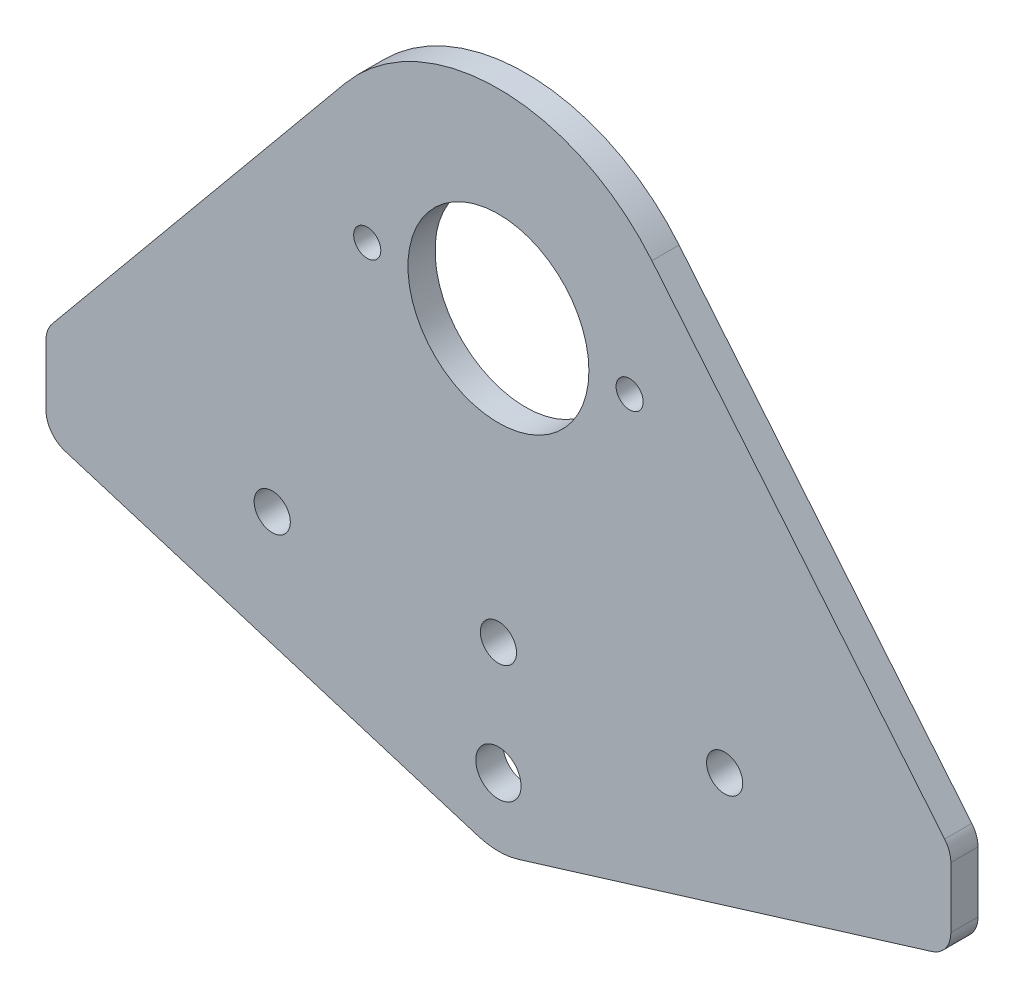
ISO-10303-21;
HEADER;
FILE_DESCRIPTION(('STEP AP214'),'2;1');
FILE_NAME('part.step','',(''),(''),'','','');
FILE_SCHEMA(('AUTOMOTIVE_DESIGN { 1 0 10303 214 1 1 1 1 }'));
ENDSEC;
DATA;
#1=APPLICATION_CONTEXT('core data for automotive mechanical design processes');
#2=APPLICATION_PROTOCOL_DEFINITION('international standard','automotive_design',2000,#1);
#3=PRODUCT_CONTEXT('',#1,'mechanical');
#4=PRODUCT('Part','Part','',(#3));
#5=PRODUCT_RELATED_PRODUCT_CATEGORY('part','',(#4));
#6=PRODUCT_DEFINITION_FORMATION('','',#4);
#7=PRODUCT_DEFINITION_CONTEXT('part definition',#1,'design');
#8=PRODUCT_DEFINITION('design','',#6,#7);
#9=PRODUCT_DEFINITION_SHAPE('','',#8);
#10=(LENGTH_UNIT() NAMED_UNIT(*) SI_UNIT(.MILLI.,.METRE.));
#11=(NAMED_UNIT(*) PLANE_ANGLE_UNIT() SI_UNIT($,.RADIAN.));
#12=(NAMED_UNIT(*) SI_UNIT($,.STERADIAN.) SOLID_ANGLE_UNIT());
#13=UNCERTAINTY_MEASURE_WITH_UNIT(LENGTH_MEASURE(1.E-05),#10,'distance_accuracy_value','');
#14=(GEOMETRIC_REPRESENTATION_CONTEXT(3) GLOBAL_UNCERTAINTY_ASSIGNED_CONTEXT((#13)) GLOBAL_UNIT_ASSIGNED_CONTEXT((#10,
#11,#12)) REPRESENTATION_CONTEXT('',''));
#15=CARTESIAN_POINT('',(0.,0.,0.));
#16=DIRECTION('',(0.,0.,1.));
#17=DIRECTION('',(1.,0.,0.));
#18=AXIS2_PLACEMENT_3D('',#15,#16,#17);
#19=CARTESIAN_POINT('',(-14.4016355712842,-46.9253292364345,3.));
#20=DIRECTION('',(0.293398533007335,0.9559902200489,0.));
#21=DIRECTION('',(-0.9559902200489,0.293398533007335,0.));
#22=AXIS2_PLACEMENT_3D('',#19,#20,#21);
#23=PLANE('',#22);
#24=DIRECTION('',(0.9559902200489,-0.293398533007335,0.));
#25=VECTOR('',#24,1.);
#26=CARTESIAN_POINT('',(-14.4016355712842,-46.9253292364345,3.));
#27=LINE('',#26,#25);
#28=CARTESIAN_POINT('',(-47.880195599022,-36.6505793557989,3.));
#29=VERTEX_POINT('',#28);
#30=CARTESIAN_POINT('',(-2.20048899755501,-50.6699266503668,3.));
#31=VERTEX_POINT('',#30);
#32=EDGE_CURVE('E138',#29,#31,#27,.T.);
#33=ORIENTED_EDGE('',*,*,#32,.F.);
#34=DIRECTION('',(0.,0.,-1.));
#35=VECTOR('',#34,1.);
#36=CARTESIAN_POINT('',(-47.880195599022,-36.6505793557989,0.));
#37=LINE('',#36,#35);
#38=CARTESIAN_POINT('',(-47.880195599022,-36.6505793557989,0.));
#39=VERTEX_POINT('',#38);
#40=EDGE_CURVE('E206',#29,#39,#37,.T.);
#41=ORIENTED_EDGE('',*,*,#40,.T.);
#42=DIRECTION('',(0.9559902200489,-0.293398533007335,0.));
#43=VECTOR('',#42,1.);
#44=CARTESIAN_POINT('',(-14.4016355712842,-46.9253292364345,0.));
#45=LINE('',#44,#43);
#46=CARTESIAN_POINT('',(-2.20048899755501,-50.6699266503668,0.));
#47=VERTEX_POINT('',#46);
#48=EDGE_CURVE('E165',#39,#47,#45,.T.);
#49=ORIENTED_EDGE('',*,*,#48,.T.);
#50=DIRECTION('',(0.,0.,-1.));
#51=VECTOR('',#50,1.);
#52=CARTESIAN_POINT('',(-2.20048899755501,-50.6699266503668,3.));
#53=LINE('',#52,#51);
#54=EDGE_CURVE('E158',#31,#47,#53,.T.);
#55=ORIENTED_EDGE('',*,*,#54,.F.);
#56=EDGE_LOOP('',(#33,#41,#49,#55));
#57=FACE_BOUND('',#56,.T.);
#58=ADVANCED_FACE('F47',(#57),#23,.F.);
#59=CARTESIAN_POINT('',(0.,-43.5,3.));
#60=DIRECTION('',(0.,0.,-1.));
#61=DIRECTION('',(-1.,0.,0.));
#62=AXIS2_PLACEMENT_3D('',#59,#60,#61);
#63=CYLINDRICAL_SURFACE('',#62,7.5);
#64=CARTESIAN_POINT('',(0.,-43.5,0.));
#65=DIRECTION('',(0.,0.,1.));
#66=DIRECTION('',(1.,0.,0.));
#67=AXIS2_PLACEMENT_3D('',#64,#65,#66);
#68=CIRCLE('',#67,7.5);
#69=CARTESIAN_POINT('',(2.20048899755501,-50.6699266503668,0.));
#70=VERTEX_POINT('',#69);
#71=EDGE_CURVE('E297',#47,#70,#68,.T.);
#72=ORIENTED_EDGE('',*,*,#71,.T.);
#73=DIRECTION('',(0.,0.,-1.));
#74=VECTOR('',#73,1.);
#75=CARTESIAN_POINT('',(2.20048899755501,-50.6699266503668,3.));
#76=LINE('',#75,#74);
#77=CARTESIAN_POINT('',(2.20048899755501,-50.6699266503668,3.));
#78=VERTEX_POINT('',#77);
#79=EDGE_CURVE('E160',#78,#70,#76,.T.);
#80=ORIENTED_EDGE('',*,*,#79,.F.);
#81=CARTESIAN_POINT('',(0.,-43.5,3.));
#82=DIRECTION('',(0.,0.,1.));
#83=DIRECTION('',(1.,0.,0.));
#84=AXIS2_PLACEMENT_3D('',#81,#82,#83);
#85=CIRCLE('',#84,7.5);
#86=EDGE_CURVE('E143',#31,#78,#85,.T.);
#87=ORIENTED_EDGE('',*,*,#86,.F.);
#88=ORIENTED_EDGE('',*,*,#54,.T.);
#89=EDGE_LOOP('',(#72,#80,#87,#88));
#90=FACE_BOUND('',#89,.T.);
#91=ADVANCED_FACE('F157',(#90),#63,.T.);
#92=CARTESIAN_POINT('',(14.4016355712843,-46.9253292364345,3.));
#93=DIRECTION('',(0.293398533007335,-0.9559902200489,0.));
#94=DIRECTION('',(0.9559902200489,0.293398533007335,0.));
#95=AXIS2_PLACEMENT_3D('',#92,#93,#94);
#96=PLANE('',#95);
#97=DIRECTION('',(-0.9559902200489,-0.293398533007335,0.));
#98=VECTOR('',#97,1.);
#99=CARTESIAN_POINT('',(14.4016355712843,-46.9253292364345,0.));
#100=LINE('',#99,#98);
#101=CARTESIAN_POINT('',(47.880195599022,-36.6505793557989,0.));
#102=VERTEX_POINT('',#101);
#103=EDGE_CURVE('E294',#102,#70,#100,.T.);
#104=ORIENTED_EDGE('',*,*,#103,.F.);
#105=DIRECTION('',(0.,0.,-1.));
#106=VECTOR('',#105,1.);
#107=CARTESIAN_POINT('',(47.880195599022,-36.6505793557989,3.));
#108=LINE('',#107,#106);
#109=CARTESIAN_POINT('',(47.880195599022,-36.6505793557989,3.));
#110=VERTEX_POINT('',#109);
#111=EDGE_CURVE('E193',#102,#110,#108,.F.);
#112=ORIENTED_EDGE('',*,*,#111,.T.);
#113=DIRECTION('',(-0.9559902200489,-0.293398533007335,0.));
#114=VECTOR('',#113,1.);
#115=CARTESIAN_POINT('',(14.4016355712843,-46.9253292364345,3.));
#116=LINE('',#115,#114);
#117=EDGE_CURVE('E162',#110,#78,#116,.T.);
#118=ORIENTED_EDGE('',*,*,#117,.T.);
#119=ORIENTED_EDGE('',*,*,#79,.T.);
#120=EDGE_LOOP('',(#104,#112,#118,#119));
#121=FACE_BOUND('',#120,.T.);
#122=ADVANCED_FACE('F343',(#121),#96,.T.);
#123=CARTESIAN_POINT('',(50.,0.,3.));
#124=DIRECTION('',(1.,0.,0.));
#125=DIRECTION('',(0.,0.,-1.));
#126=AXIS2_PLACEMENT_3D('',#123,#124,#125);
#127=PLANE('',#126);
#128=DIRECTION('',(0.,-1.,0.));
#129=VECTOR('',#128,1.);
#130=CARTESIAN_POINT('',(50.,0.,3.));
#131=LINE('',#130,#129);
#132=CARTESIAN_POINT('',(50.,-27.0785202951788,3.));
#133=VERTEX_POINT('',#132);
#134=CARTESIAN_POINT('',(50.,-33.7826086956522,3.));
#135=VERTEX_POINT('',#134);
#136=EDGE_CURVE('E336',#133,#135,#131,.T.);
#137=ORIENTED_EDGE('',*,*,#136,.T.);
#138=DIRECTION('',(0.,0.,-1.));
#139=VECTOR('',#138,1.);
#140=CARTESIAN_POINT('',(50.,-33.7826086956522,3.));
#141=LINE('',#140,#139);
#142=CARTESIAN_POINT('',(50.,-33.7826086956522,0.));
#143=VERTEX_POINT('',#142);
#144=EDGE_CURVE('E172',#135,#143,#141,.T.);
#145=ORIENTED_EDGE('',*,*,#144,.T.);
#146=DIRECTION('',(0.,-1.,0.));
#147=VECTOR('',#146,1.);
#148=CARTESIAN_POINT('',(50.,0.,0.));
#149=LINE('',#148,#147);
#150=CARTESIAN_POINT('',(50.,-27.0785202951788,0.));
#151=VERTEX_POINT('',#150);
#152=EDGE_CURVE('E289',#151,#143,#149,.T.);
#153=ORIENTED_EDGE('',*,*,#152,.F.);
#154=DIRECTION('',(0.,0.,-1.));
#155=VECTOR('',#154,1.);
#156=CARTESIAN_POINT('',(50.,-27.0785202951788,3.));
#157=LINE('',#156,#155);
#158=EDGE_CURVE('E168',#151,#133,#157,.F.);
#159=ORIENTED_EDGE('',*,*,#158,.T.);
#160=EDGE_LOOP('',(#137,#145,#153,#159));
#161=FACE_BOUND('',#160,.T.);
#162=ADVANCED_FACE('F352',(#161),#127,.T.);
#163=CARTESIAN_POINT('',(16.9640826864656,14.0078513201261,3.));
#164=DIRECTION('',(-0.771094667566617,-0.636720514551187,0.));
#165=DIRECTION('',(0.636720514551187,-0.771094667566617,0.));
#166=AXIS2_PLACEMENT_3D('',#163,#164,#165);
#167=PLANE('',#166);
#168=DIRECTION('',(-0.636720514551187,0.771094667566617,0.));
#169=VECTOR('',#168,1.);
#170=CARTESIAN_POINT('',(16.9640826864656,14.0078513201261,3.));
#171=LINE('',#170,#169);
#172=CARTESIAN_POINT('',(49.3132840026999,-25.1683587515252,3.));
#173=VERTEX_POINT('',#172);
#174=CARTESIAN_POINT('',(16.9640826864656,14.0078513201261,3.));
#175=VERTEX_POINT('',#174);
#176=EDGE_CURVE('E333',#173,#175,#171,.T.);
#177=ORIENTED_EDGE('',*,*,#176,.F.);
#178=DIRECTION('',(0.,0.,-1.));
#179=VECTOR('',#178,1.);
#180=CARTESIAN_POINT('',(49.3132840026999,-25.1683587515252,0.));
#181=LINE('',#180,#179);
#182=CARTESIAN_POINT('',(49.3132840026999,-25.1683587515252,0.));
#183=VERTEX_POINT('',#182);
#184=EDGE_CURVE('E11',#173,#183,#181,.T.);
#185=ORIENTED_EDGE('',*,*,#184,.T.);
#186=DIRECTION('',(-0.636720514551187,0.771094667566617,0.));
#187=VECTOR('',#186,1.);
#188=CARTESIAN_POINT('',(16.9640826864656,14.0078513201261,0.));
#189=LINE('',#188,#187);
#190=CARTESIAN_POINT('',(16.9640826864656,14.0078513201261,0.));
#191=VERTEX_POINT('',#190);
#192=EDGE_CURVE('E286',#183,#191,#189,.T.);
#193=ORIENTED_EDGE('',*,*,#192,.T.);
#194=DIRECTION('',(0.,0.,-1.));
#195=VECTOR('',#194,1.);
#196=CARTESIAN_POINT('',(16.9640826864656,14.0078513201261,3.));
#197=LINE('',#196,#195);
#198=EDGE_CURVE('E174',#175,#191,#197,.T.);
#199=ORIENTED_EDGE('',*,*,#198,.F.);
#200=EDGE_LOOP('',(#177,#185,#193,#199));
#201=FACE_BOUND('',#200,.T.);
#202=ADVANCED_FACE('F357',(#201),#167,.F.);
#203=CARTESIAN_POINT('',(0.,0.,3.));
#204=DIRECTION('',(0.,0.,-1.));
#205=DIRECTION('',(-1.,0.,0.));
#206=AXIS2_PLACEMENT_3D('',#203,#204,#205);
#207=CYLINDRICAL_SURFACE('',#206,22.);
#208=CARTESIAN_POINT('',(0.,0.,0.));
#209=DIRECTION('',(0.,0.,1.));
#210=DIRECTION('',(1.,0.,0.));
#211=AXIS2_PLACEMENT_3D('',#208,#209,#210);
#212=CIRCLE('',#211,22.);
#213=CARTESIAN_POINT('',(-16.9640826864656,14.0078513201261,0.));
#214=VERTEX_POINT('',#213);
#215=EDGE_CURVE('E247',#191,#214,#212,.T.);
#216=ORIENTED_EDGE('',*,*,#215,.T.);
#217=DIRECTION('',(0.,0.,-1.));
#218=VECTOR('',#217,1.);
#219=CARTESIAN_POINT('',(-16.9640826864656,14.0078513201261,3.));
#220=LINE('',#219,#218);
#221=CARTESIAN_POINT('',(-16.9640826864656,14.0078513201261,3.));
#222=VERTEX_POINT('',#221);
#223=EDGE_CURVE('E273',#222,#214,#220,.T.);
#224=ORIENTED_EDGE('',*,*,#223,.F.);
#225=CARTESIAN_POINT('',(0.,0.,3.));
#226=DIRECTION('',(0.,0.,1.));
#227=DIRECTION('',(1.,0.,0.));
#228=AXIS2_PLACEMENT_3D('',#225,#226,#227);
#229=CIRCLE('',#228,22.);
#230=EDGE_CURVE('E225',#175,#222,#229,.T.);
#231=ORIENTED_EDGE('',*,*,#230,.F.);
#232=ORIENTED_EDGE('',*,*,#198,.T.);
#233=EDGE_LOOP('',(#216,#224,#231,#232));
#234=FACE_BOUND('',#233,.T.);
#235=ADVANCED_FACE('F282',(#234),#207,.T.);
#236=CARTESIAN_POINT('',(-16.9640826864656,14.0078513201261,3.));
#237=DIRECTION('',(-0.771094667566617,0.636720514551187,0.));
#238=DIRECTION('',(-0.636720514551187,-0.771094667566617,0.));
#239=AXIS2_PLACEMENT_3D('',#236,#237,#238);
#240=PLANE('',#239);
#241=DIRECTION('',(0.636720514551187,0.771094667566617,0.));
#242=VECTOR('',#241,1.);
#243=CARTESIAN_POINT('',(-16.9640826864656,14.0078513201261,0.));
#244=LINE('',#243,#242);
#245=CARTESIAN_POINT('',(-49.3132840026999,-25.1683587515253,0.));
#246=VERTEX_POINT('',#245);
#247=EDGE_CURVE('E222',#246,#214,#244,.T.);
#248=ORIENTED_EDGE('',*,*,#247,.F.);
#249=DIRECTION('',(0.,0.,-1.));
#250=VECTOR('',#249,1.);
#251=CARTESIAN_POINT('',(-49.3132840026999,-25.1683587515253,3.));
#252=LINE('',#251,#250);
#253=CARTESIAN_POINT('',(-49.3132840026999,-25.1683587515253,3.));
#254=VERTEX_POINT('',#253);
#255=EDGE_CURVE('E56',#246,#254,#252,.F.);
#256=ORIENTED_EDGE('',*,*,#255,.T.);
#257=DIRECTION('',(0.636720514551187,0.771094667566617,0.));
#258=VECTOR('',#257,1.);
#259=CARTESIAN_POINT('',(-16.9640826864656,14.0078513201261,3.));
#260=LINE('',#259,#258);
#261=EDGE_CURVE('E220',#254,#222,#260,.T.);
#262=ORIENTED_EDGE('',*,*,#261,.T.);
#263=ORIENTED_EDGE('',*,*,#223,.T.);
#264=EDGE_LOOP('',(#248,#256,#262,#263));
#265=FACE_BOUND('',#264,.T.);
#266=ADVANCED_FACE('F218',(#265),#240,.T.);
#267=CARTESIAN_POINT('',(14.5,0.,3.));
#268=DIRECTION('',(0.,0.,-1.));
#269=DIRECTION('',(-1.,0.,0.));
#270=AXIS2_PLACEMENT_3D('',#267,#268,#269);
#271=CYLINDRICAL_SURFACE('',#270,1.5);
#272=CARTESIAN_POINT('',(14.5,0.,3.));
#273=DIRECTION('',(0.,0.,1.));
#274=DIRECTION('',(1.,0.,0.));
#275=AXIS2_PLACEMENT_3D('',#272,#273,#274);
#276=CIRCLE('',#275,1.5);
#277=CARTESIAN_POINT('',(16.,0.,3.));
#278=VERTEX_POINT('',#277);
#279=EDGE_CURVE('E305',#278,#278,#276,.F.);
#280=ORIENTED_EDGE('',*,*,#279,.F.);
#281=EDGE_LOOP('',(#280));
#282=FACE_BOUND('',#281,.T.);
#283=CARTESIAN_POINT('',(14.5,0.,0.));
#284=DIRECTION('',(0.,0.,1.));
#285=DIRECTION('',(1.,0.,0.));
#286=AXIS2_PLACEMENT_3D('',#283,#284,#285);
#287=CIRCLE('',#286,1.5);
#288=CARTESIAN_POINT('',(16.,0.,0.));
#289=VERTEX_POINT('',#288);
#290=EDGE_CURVE('E266',#289,#289,#287,.F.);
#291=ORIENTED_EDGE('',*,*,#290,.T.);
#292=EDGE_LOOP('',(#291));
#293=FACE_BOUND('',#292,.T.);
#294=ADVANCED_FACE('F487',(#282,#293),#271,.F.);
#295=CARTESIAN_POINT('',(-14.5,0.,3.));
#296=DIRECTION('',(0.,0.,-1.));
#297=DIRECTION('',(-1.,0.,0.));
#298=AXIS2_PLACEMENT_3D('',#295,#296,#297);
#299=CYLINDRICAL_SURFACE('',#298,1.5);
#300=CARTESIAN_POINT('',(-14.5,0.,3.));
#301=DIRECTION('',(0.,0.,1.));
#302=DIRECTION('',(1.,0.,0.));
#303=AXIS2_PLACEMENT_3D('',#300,#301,#302);
#304=CIRCLE('',#303,1.5);
#305=CARTESIAN_POINT('',(-13.,0.,3.));
#306=VERTEX_POINT('',#305);
#307=EDGE_CURVE('E309',#306,#306,#304,.T.);
#308=ORIENTED_EDGE('',*,*,#307,.T.);
#309=EDGE_LOOP('',(#308));
#310=FACE_BOUND('',#309,.T.);
#311=CARTESIAN_POINT('',(-14.5,0.,0.));
#312=DIRECTION('',(0.,0.,1.));
#313=DIRECTION('',(1.,0.,0.));
#314=AXIS2_PLACEMENT_3D('',#311,#312,#313);
#315=CIRCLE('',#314,1.5);
#316=CARTESIAN_POINT('',(-13.,0.,0.));
#317=VERTEX_POINT('',#316);
#318=EDGE_CURVE('E262',#317,#317,#315,.T.);
#319=ORIENTED_EDGE('',*,*,#318,.F.);
#320=EDGE_LOOP('',(#319));
#321=FACE_BOUND('',#320,.T.);
#322=ADVANCED_FACE('F477',(#310,#321),#299,.F.);
#323=CARTESIAN_POINT('',(0.,0.,3.));
#324=DIRECTION('',(0.,0.,-1.));
#325=DIRECTION('',(-1.,0.,0.));
#326=AXIS2_PLACEMENT_3D('',#323,#324,#325);
#327=CYLINDRICAL_SURFACE('',#326,10.);
#328=CARTESIAN_POINT('',(0.,0.,3.));
#329=DIRECTION('',(0.,0.,1.));
#330=DIRECTION('',(1.,0.,0.));
#331=AXIS2_PLACEMENT_3D('',#328,#329,#330);
#332=CIRCLE('',#331,10.);
#333=CARTESIAN_POINT('',(10.,0.,3.));
#334=VERTEX_POINT('',#333);
#335=EDGE_CURVE('E313',#334,#334,#332,.T.);
#336=ORIENTED_EDGE('',*,*,#335,.T.);
#337=EDGE_LOOP('',(#336));
#338=FACE_BOUND('',#337,.T.);
#339=CARTESIAN_POINT('',(0.,0.,0.));
#340=DIRECTION('',(0.,0.,1.));
#341=DIRECTION('',(1.,0.,0.));
#342=AXIS2_PLACEMENT_3D('',#339,#340,#341);
#343=CIRCLE('',#342,10.);
#344=CARTESIAN_POINT('',(10.,0.,0.));
#345=VERTEX_POINT('',#344);
#346=EDGE_CURVE('E258',#345,#345,#343,.T.);
#347=ORIENTED_EDGE('',*,*,#346,.F.);
#348=EDGE_LOOP('',(#347));
#349=FACE_BOUND('',#348,.T.);
#350=ADVANCED_FACE('F467',(#338,#349),#327,.F.);
#351=CARTESIAN_POINT('',(25.,-31.,3.));
#352=DIRECTION('',(0.,0.,-1.));
#353=DIRECTION('',(-1.,0.,0.));
#354=AXIS2_PLACEMENT_3D('',#351,#352,#353);
#355=CYLINDRICAL_SURFACE('',#354,2.);
#356=CARTESIAN_POINT('',(25.,-31.,3.));
#357=DIRECTION('',(0.,0.,1.));
#358=DIRECTION('',(1.,0.,0.));
#359=AXIS2_PLACEMENT_3D('',#356,#357,#358);
#360=CIRCLE('',#359,2.);
#361=CARTESIAN_POINT('',(27.,-31.,3.));
#362=VERTEX_POINT('',#361);
#363=EDGE_CURVE('E317',#362,#362,#360,.F.);
#364=ORIENTED_EDGE('',*,*,#363,.F.);
#365=EDGE_LOOP('',(#364));
#366=FACE_BOUND('',#365,.T.);
#367=CARTESIAN_POINT('',(25.,-31.,0.));
#368=DIRECTION('',(0.,0.,1.));
#369=DIRECTION('',(1.,0.,0.));
#370=AXIS2_PLACEMENT_3D('',#367,#368,#369);
#371=CIRCLE('',#370,2.);
#372=CARTESIAN_POINT('',(27.,-31.,0.));
#373=VERTEX_POINT('',#372);
#374=EDGE_CURVE('E254',#373,#373,#371,.F.);
#375=ORIENTED_EDGE('',*,*,#374,.T.);
#376=EDGE_LOOP('',(#375));
#377=FACE_BOUND('',#376,.T.);
#378=ADVANCED_FACE('F457',(#366,#377),#355,.F.);
#379=CARTESIAN_POINT('',(-25.,-31.,3.));
#380=DIRECTION('',(0.,0.,-1.));
#381=DIRECTION('',(-1.,0.,0.));
#382=AXIS2_PLACEMENT_3D('',#379,#380,#381);
#383=CYLINDRICAL_SURFACE('',#382,2.);
#384=CARTESIAN_POINT('',(-25.,-31.,3.));
#385=DIRECTION('',(0.,0.,1.));
#386=DIRECTION('',(1.,0.,0.));
#387=AXIS2_PLACEMENT_3D('',#384,#385,#386);
#388=CIRCLE('',#387,2.);
#389=CARTESIAN_POINT('',(-23.,-31.,3.));
#390=VERTEX_POINT('',#389);
#391=EDGE_CURVE('E321',#390,#390,#388,.T.);
#392=ORIENTED_EDGE('',*,*,#391,.T.);
#393=EDGE_LOOP('',(#392));
#394=FACE_BOUND('',#393,.T.);
#395=CARTESIAN_POINT('',(-25.,-31.,0.));
#396=DIRECTION('',(0.,0.,1.));
#397=DIRECTION('',(1.,0.,0.));
#398=AXIS2_PLACEMENT_3D('',#395,#396,#397);
#399=CIRCLE('',#398,2.);
#400=CARTESIAN_POINT('',(-23.,-31.,0.));
#401=VERTEX_POINT('',#400);
#402=EDGE_CURVE('E245',#401,#401,#399,.T.);
#403=ORIENTED_EDGE('',*,*,#402,.F.);
#404=EDGE_LOOP('',(#403));
#405=FACE_BOUND('',#404,.T.);
#406=ADVANCED_FACE('F447',(#394,#405),#383,.F.);
#407=CARTESIAN_POINT('',(0.,-31.,3.));
#408=DIRECTION('',(0.,0.,-1.));
#409=DIRECTION('',(-1.,0.,0.));
#410=AXIS2_PLACEMENT_3D('',#407,#408,#409);
#411=CYLINDRICAL_SURFACE('',#410,2.);
#412=CARTESIAN_POINT('',(0.,-31.,3.));
#413=DIRECTION('',(0.,0.,1.));
#414=DIRECTION('',(1.,0.,0.));
#415=AXIS2_PLACEMENT_3D('',#412,#413,#414);
#416=CIRCLE('',#415,2.);
#417=CARTESIAN_POINT('',(2.,-31.,3.));
#418=VERTEX_POINT('',#417);
#419=EDGE_CURVE('E325',#418,#418,#416,.T.);
#420=ORIENTED_EDGE('',*,*,#419,.T.);
#421=EDGE_LOOP('',(#420));
#422=FACE_BOUND('',#421,.T.);
#423=CARTESIAN_POINT('',(0.,-31.,0.));
#424=DIRECTION('',(0.,0.,1.));
#425=DIRECTION('',(1.,0.,0.));
#426=AXIS2_PLACEMENT_3D('',#423,#424,#425);
#427=CIRCLE('',#426,2.);
#428=CARTESIAN_POINT('',(2.,-31.,0.));
#429=VERTEX_POINT('',#428);
#430=EDGE_CURVE('E240',#429,#429,#427,.T.);
#431=ORIENTED_EDGE('',*,*,#430,.F.);
#432=EDGE_LOOP('',(#431));
#433=FACE_BOUND('',#432,.T.);
#434=ADVANCED_FACE('F438',(#422,#433),#411,.F.);
#435=CARTESIAN_POINT('',(-50.,0.,3.));
#436=DIRECTION('',(-1.,0.,0.));
#437=DIRECTION('',(0.,0.,1.));
#438=AXIS2_PLACEMENT_3D('',#435,#436,#437);
#439=PLANE('',#438);
#440=DIRECTION('',(0.,1.,0.));
#441=VECTOR('',#440,1.);
#442=CARTESIAN_POINT('',(-50.,0.,0.));
#443=LINE('',#442,#441);
#444=CARTESIAN_POINT('',(-50.,-33.7826086956522,0.));
#445=VERTEX_POINT('',#444);
#446=CARTESIAN_POINT('',(-50.,-27.0785202951788,0.));
#447=VERTEX_POINT('',#446);
#448=EDGE_CURVE('E234',#445,#447,#443,.T.);
#449=ORIENTED_EDGE('',*,*,#448,.F.);
#450=DIRECTION('',(0.,0.,-1.));
#451=VECTOR('',#450,1.);
#452=CARTESIAN_POINT('',(-50.,-33.7826086956522,3.));
#453=LINE('',#452,#451);
#454=CARTESIAN_POINT('',(-50.,-33.7826086956522,3.));
#455=VERTEX_POINT('',#454);
#456=EDGE_CURVE('E70',#445,#455,#453,.F.);
#457=ORIENTED_EDGE('',*,*,#456,.T.);
#458=DIRECTION('',(0.,1.,0.));
#459=VECTOR('',#458,1.);
#460=CARTESIAN_POINT('',(-50.,0.,3.));
#461=LINE('',#460,#459);
#462=CARTESIAN_POINT('',(-50.,-27.0785202951788,3.));
#463=VERTEX_POINT('',#462);
#464=EDGE_CURVE('E228',#455,#463,#461,.T.);
#465=ORIENTED_EDGE('',*,*,#464,.T.);
#466=DIRECTION('',(0.,0.,-1.));
#467=VECTOR('',#466,1.);
#468=CARTESIAN_POINT('',(-50.,-27.0785202951788,3.));
#469=LINE('',#468,#467);
#470=EDGE_CURVE('E209',#463,#447,#469,.T.);
#471=ORIENTED_EDGE('',*,*,#470,.T.);
#472=EDGE_LOOP('',(#449,#457,#465,#471));
#473=FACE_BOUND('',#472,.T.);
#474=ADVANCED_FACE('F233',(#473),#439,.T.);
#475=CARTESIAN_POINT('',(0.,-43.5,3.));
#476=DIRECTION('',(0.,0.,-1.));
#477=DIRECTION('',(-1.,0.,0.));
#478=AXIS2_PLACEMENT_3D('',#475,#476,#477);
#479=CYLINDRICAL_SURFACE('',#478,2.5);
#480=CARTESIAN_POINT('',(0.,-43.5,3.));
#481=DIRECTION('',(0.,0.,1.));
#482=DIRECTION('',(1.,0.,0.));
#483=AXIS2_PLACEMENT_3D('',#480,#481,#482);
#484=CIRCLE('',#483,2.5);
#485=CARTESIAN_POINT('',(2.5,-43.5,3.));
#486=VERTEX_POINT('',#485);
#487=EDGE_CURVE('E275',#486,#486,#484,.T.);
#488=ORIENTED_EDGE('',*,*,#487,.T.);
#489=EDGE_LOOP('',(#488));
#490=FACE_BOUND('',#489,.T.);
#491=CARTESIAN_POINT('',(0.,-43.5,0.));
#492=DIRECTION('',(0.,0.,1.));
#493=DIRECTION('',(1.,0.,0.));
#494=AXIS2_PLACEMENT_3D('',#491,#492,#493);
#495=CIRCLE('',#494,2.5);
#496=CARTESIAN_POINT('',(2.5,-43.5,0.));
#497=VERTEX_POINT('',#496);
#498=EDGE_CURVE('E152',#497,#497,#495,.T.);
#499=ORIENTED_EDGE('',*,*,#498,.F.);
#500=EDGE_LOOP('',(#499));
#501=FACE_BOUND('',#500,.T.);
#502=ADVANCED_FACE('F418',(#490,#501),#479,.F.);
#503=CARTESIAN_POINT('',(0.,0.,3.));
#504=DIRECTION('',(0.,0.,1.));
#505=DIRECTION('',(1.,0.,0.));
#506=AXIS2_PLACEMENT_3D('',#503,#504,#505);
#507=PLANE('',#506);
#508=ORIENTED_EDGE('',*,*,#117,.F.);
#509=CARTESIAN_POINT('',(47.,-33.7826086956522,3.));
#510=DIRECTION('',(0.,0.,1.));
#511=DIRECTION('',(1.,0.,0.));
#512=AXIS2_PLACEMENT_3D('',#509,#510,#511);
#513=CIRCLE('',#512,3.);
#514=EDGE_CURVE('E203',#110,#135,#513,.T.);
#515=ORIENTED_EDGE('',*,*,#514,.T.);
#516=ORIENTED_EDGE('',*,*,#136,.F.);
#517=CARTESIAN_POINT('',(47.,-27.0785202951788,3.));
#518=DIRECTION('',(0.,0.,1.));
#519=DIRECTION('',(1.,0.,0.));
#520=AXIS2_PLACEMENT_3D('',#517,#518,#519);
#521=CIRCLE('',#520,3.);
#522=EDGE_CURVE('E196',#133,#173,#521,.T.);
#523=ORIENTED_EDGE('',*,*,#522,.T.);
#524=ORIENTED_EDGE('',*,*,#176,.T.);
#525=ORIENTED_EDGE('',*,*,#230,.T.);
#526=ORIENTED_EDGE('',*,*,#261,.F.);
#527=CARTESIAN_POINT('',(-47.,-27.0785202951788,3.));
#528=DIRECTION('',(0.,0.,1.));
#529=DIRECTION('',(1.,0.,0.));
#530=AXIS2_PLACEMENT_3D('',#527,#528,#529);
#531=CIRCLE('',#530,3.);
#532=EDGE_CURVE('E63',#254,#463,#531,.T.);
#533=ORIENTED_EDGE('',*,*,#532,.T.);
#534=ORIENTED_EDGE('',*,*,#464,.F.);
#535=CARTESIAN_POINT('',(-47.,-33.7826086956522,3.));
#536=DIRECTION('',(0.,0.,1.));
#537=DIRECTION('',(1.,0.,0.));
#538=AXIS2_PLACEMENT_3D('',#535,#536,#537);
#539=CIRCLE('',#538,3.);
#540=EDGE_CURVE('E146',#455,#29,#539,.T.);
#541=ORIENTED_EDGE('',*,*,#540,.T.);
#542=ORIENTED_EDGE('',*,*,#32,.T.);
#543=ORIENTED_EDGE('',*,*,#86,.T.);
#544=EDGE_LOOP('',(#508,#515,#516,#523,#524,#525,#526,#533,#534,#541,#542,#543));
#545=FACE_BOUND('',#544,.T.);
#546=ORIENTED_EDGE('',*,*,#419,.F.);
#547=EDGE_LOOP('',(#546));
#548=FACE_BOUND('',#547,.T.);
#549=ORIENTED_EDGE('',*,*,#391,.F.);
#550=EDGE_LOOP('',(#549));
#551=FACE_BOUND('',#550,.T.);
#552=ORIENTED_EDGE('',*,*,#363,.T.);
#553=EDGE_LOOP('',(#552));
#554=FACE_BOUND('',#553,.T.);
#555=ORIENTED_EDGE('',*,*,#335,.F.);
#556=EDGE_LOOP('',(#555));
#557=FACE_BOUND('',#556,.T.);
#558=ORIENTED_EDGE('',*,*,#307,.F.);
#559=EDGE_LOOP('',(#558));
#560=FACE_BOUND('',#559,.T.);
#561=ORIENTED_EDGE('',*,*,#279,.T.);
#562=EDGE_LOOP('',(#561));
#563=FACE_BOUND('',#562,.T.);
#564=ORIENTED_EDGE('',*,*,#487,.F.);
#565=EDGE_LOOP('',(#564));
#566=FACE_BOUND('',#565,.T.);
#567=ADVANCED_FACE('F141',(#545,#548,#551,#554,#557,#560,#563,#566),#507,.T.);
#568=CARTESIAN_POINT('',(0.,0.,0.));
#569=DIRECTION('',(0.,0.,1.));
#570=DIRECTION('',(1.,0.,0.));
#571=AXIS2_PLACEMENT_3D('',#568,#569,#570);
#572=PLANE('',#571);
#573=ORIENTED_EDGE('',*,*,#152,.T.);
#574=CARTESIAN_POINT('',(47.,-33.7826086956522,0.));
#575=DIRECTION('',(0.,0.,1.));
#576=DIRECTION('',(1.,0.,0.));
#577=AXIS2_PLACEMENT_3D('',#574,#575,#576);
#578=CIRCLE('',#577,3.);
#579=EDGE_CURVE('E190',#143,#102,#578,.F.);
#580=ORIENTED_EDGE('',*,*,#579,.T.);
#581=ORIENTED_EDGE('',*,*,#103,.T.);
#582=ORIENTED_EDGE('',*,*,#71,.F.);
#583=ORIENTED_EDGE('',*,*,#48,.F.);
#584=CARTESIAN_POINT('',(-47.,-33.7826086956522,0.));
#585=DIRECTION('',(0.,0.,1.));
#586=DIRECTION('',(1.,0.,0.));
#587=AXIS2_PLACEMENT_3D('',#584,#585,#586);
#588=CIRCLE('',#587,3.);
#589=EDGE_CURVE('E187',#39,#445,#588,.F.);
#590=ORIENTED_EDGE('',*,*,#589,.T.);
#591=ORIENTED_EDGE('',*,*,#448,.T.);
#592=CARTESIAN_POINT('',(-47.,-27.0785202951788,0.));
#593=DIRECTION('',(0.,0.,1.));
#594=DIRECTION('',(1.,0.,0.));
#595=AXIS2_PLACEMENT_3D('',#592,#593,#594);
#596=CIRCLE('',#595,3.);
#597=EDGE_CURVE('E184',#447,#246,#596,.F.);
#598=ORIENTED_EDGE('',*,*,#597,.T.);
#599=ORIENTED_EDGE('',*,*,#247,.T.);
#600=ORIENTED_EDGE('',*,*,#215,.F.);
#601=ORIENTED_EDGE('',*,*,#192,.F.);
#602=CARTESIAN_POINT('',(47.,-27.0785202951788,0.));
#603=DIRECTION('',(0.,0.,1.));
#604=DIRECTION('',(1.,0.,0.));
#605=AXIS2_PLACEMENT_3D('',#602,#603,#604);
#606=CIRCLE('',#605,3.);
#607=EDGE_CURVE('E181',#183,#151,#606,.F.);
#608=ORIENTED_EDGE('',*,*,#607,.T.);
#609=EDGE_LOOP('',(#573,#580,#581,#582,#583,#590,#591,#598,#599,#600,#601,#608));
#610=FACE_BOUND('',#609,.T.);
#611=ORIENTED_EDGE('',*,*,#430,.T.);
#612=EDGE_LOOP('',(#611));
#613=FACE_BOUND('',#612,.T.);
#614=ORIENTED_EDGE('',*,*,#402,.T.);
#615=EDGE_LOOP('',(#614));
#616=FACE_BOUND('',#615,.T.);
#617=ORIENTED_EDGE('',*,*,#374,.F.);
#618=EDGE_LOOP('',(#617));
#619=FACE_BOUND('',#618,.T.);
#620=ORIENTED_EDGE('',*,*,#346,.T.);
#621=EDGE_LOOP('',(#620));
#622=FACE_BOUND('',#621,.T.);
#623=ORIENTED_EDGE('',*,*,#318,.T.);
#624=EDGE_LOOP('',(#623));
#625=FACE_BOUND('',#624,.T.);
#626=ORIENTED_EDGE('',*,*,#290,.F.);
#627=EDGE_LOOP('',(#626));
#628=FACE_BOUND('',#627,.T.);
#629=ORIENTED_EDGE('',*,*,#498,.T.);
#630=EDGE_LOOP('',(#629));
#631=FACE_BOUND('',#630,.T.);
#632=ADVANCED_FACE('F237',(#610,#613,#616,#619,#622,#625,#628,#631),#572,.F.);
#633=CARTESIAN_POINT('',(47.,-33.7826086956522,3.));
#634=DIRECTION('',(0.,0.,-1.));
#635=DIRECTION('',(-1.,0.,0.));
#636=AXIS2_PLACEMENT_3D('',#633,#634,#635);
#637=CYLINDRICAL_SURFACE('',#636,3.);
#638=ORIENTED_EDGE('',*,*,#514,.F.);
#639=ORIENTED_EDGE('',*,*,#111,.F.);
#640=ORIENTED_EDGE('',*,*,#579,.F.);
#641=ORIENTED_EDGE('',*,*,#144,.F.);
#642=EDGE_LOOP('',(#638,#639,#640,#641));
#643=FACE_BOUND('',#642,.T.);
#644=ADVANCED_FACE('F349',(#643),#637,.T.);
#645=CARTESIAN_POINT('',(-47.,-33.7826086956522,3.));
#646=DIRECTION('',(0.,0.,1.));
#647=DIRECTION('',(1.,0.,0.));
#648=AXIS2_PLACEMENT_3D('',#645,#646,#647);
#649=CYLINDRICAL_SURFACE('',#648,3.);
#650=ORIENTED_EDGE('',*,*,#540,.F.);
#651=ORIENTED_EDGE('',*,*,#456,.F.);
#652=ORIENTED_EDGE('',*,*,#589,.F.);
#653=ORIENTED_EDGE('',*,*,#40,.F.);
#654=EDGE_LOOP('',(#650,#651,#652,#653));
#655=FACE_BOUND('',#654,.T.);
#656=ADVANCED_FACE('F376',(#655),#649,.T.);
#657=CARTESIAN_POINT('',(-47.,-27.0785202951788,3.));
#658=DIRECTION('',(0.,0.,-1.));
#659=DIRECTION('',(-1.,0.,0.));
#660=AXIS2_PLACEMENT_3D('',#657,#658,#659);
#661=CYLINDRICAL_SURFACE('',#660,3.);
#662=ORIENTED_EDGE('',*,*,#532,.F.);
#663=ORIENTED_EDGE('',*,*,#255,.F.);
#664=ORIENTED_EDGE('',*,*,#597,.F.);
#665=ORIENTED_EDGE('',*,*,#470,.F.);
#666=EDGE_LOOP('',(#662,#663,#664,#665));
#667=FACE_BOUND('',#666,.T.);
#668=ADVANCED_FACE('F231',(#667),#661,.T.);
#669=CARTESIAN_POINT('',(47.,-27.0785202951788,3.));
#670=DIRECTION('',(0.,0.,1.));
#671=DIRECTION('',(1.,0.,0.));
#672=AXIS2_PLACEMENT_3D('',#669,#670,#671);
#673=CYLINDRICAL_SURFACE('',#672,3.);
#674=ORIENTED_EDGE('',*,*,#522,.F.);
#675=ORIENTED_EDGE('',*,*,#158,.F.);
#676=ORIENTED_EDGE('',*,*,#607,.F.);
#677=ORIENTED_EDGE('',*,*,#184,.F.);
#678=EDGE_LOOP('',(#674,#675,#676,#677));
#679=FACE_BOUND('',#678,.T.);
#680=ADVANCED_FACE('F49',(#679),#673,.T.);
#681=CLOSED_SHELL('',(#58,#91,#122,#162,#202,#235,#266,#294,#322,#350,#378,#406,#434,#474,#502,
#567,#632,#644,#656,#668,#680));
#682=MANIFOLD_SOLID_BREP('B2',#681);
#683=ADVANCED_BREP_SHAPE_REPRESENTATION('',(#18,#682),#14);
#684=SHAPE_DEFINITION_REPRESENTATION(#9,#683);
ENDSEC;
END-ISO-10303-21;
